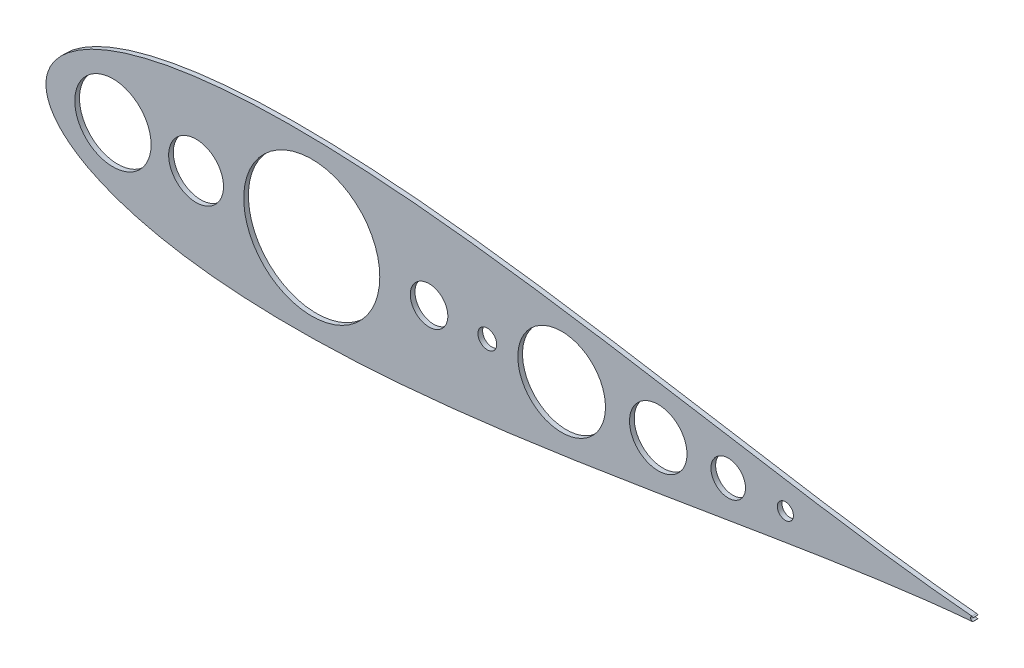
ISO-10303-21;
HEADER;
FILE_DESCRIPTION(('STEP AP214'),'2;1');
FILE_NAME('part.step','',(''),(''),'','','');
FILE_SCHEMA(('AUTOMOTIVE_DESIGN { 1 0 10303 214 1 1 1 1 }'));
ENDSEC;
DATA;
#1=APPLICATION_CONTEXT('core data for automotive mechanical design processes');
#2=APPLICATION_PROTOCOL_DEFINITION('international standard','automotive_design',2000,#1);
#3=PRODUCT_CONTEXT('',#1,'mechanical');
#4=PRODUCT('Part','Part','',(#3));
#5=PRODUCT_RELATED_PRODUCT_CATEGORY('part','',(#4));
#6=PRODUCT_DEFINITION_FORMATION('','',#4);
#7=PRODUCT_DEFINITION_CONTEXT('part definition',#1,'design');
#8=PRODUCT_DEFINITION('design','',#6,#7);
#9=PRODUCT_DEFINITION_SHAPE('','',#8);
#10=(LENGTH_UNIT() NAMED_UNIT(*) SI_UNIT(.MILLI.,.METRE.));
#11=(NAMED_UNIT(*) PLANE_ANGLE_UNIT() SI_UNIT($,.RADIAN.));
#12=(NAMED_UNIT(*) SI_UNIT($,.STERADIAN.) SOLID_ANGLE_UNIT());
#13=UNCERTAINTY_MEASURE_WITH_UNIT(LENGTH_MEASURE(1.E-05),#10,'distance_accuracy_value','');
#14=(GEOMETRIC_REPRESENTATION_CONTEXT(3) GLOBAL_UNCERTAINTY_ASSIGNED_CONTEXT((#13)) GLOBAL_UNIT_ASSIGNED_CONTEXT((#10,
#11,#12)) REPRESENTATION_CONTEXT('',''));
#15=CARTESIAN_POINT('',(0.,0.,0.));
#16=DIRECTION('',(0.,0.,1.));
#17=DIRECTION('',(1.,0.,0.));
#18=AXIS2_PLACEMENT_3D('',#15,#16,#17);
#19=CARTESIAN_POINT('',(758.723197977063,1063.57436572714,4.76249999999927));
#20=DIRECTION('',(0.,0.,1.));
#21=DIRECTION('',(1.,0.,0.));
#22=AXIS2_PLACEMENT_3D('',#19,#20,#21);
#23=PLANE('',#22);
#24=CARTESIAN_POINT('',(1219.83442511048,1063.57436573083,4.76249999999927));
#25=DIRECTION('',(0.,0.,1.));
#26=DIRECTION('',(1.,0.,0.));
#27=AXIS2_PLACEMENT_3D('',#24,#25,#26);
#28=CIRCLE('',#27,11.6857374411643);
#29=CARTESIAN_POINT('',(1231.52016255164,1063.57436573083,4.76249999999927));
#30=VERTEX_POINT('',#29);
#31=EDGE_CURVE('E163',#30,#30,#28,.T.);
#32=ORIENTED_EDGE('',*,*,#31,.F.);
#33=EDGE_LOOP('',(#32));
#34=FACE_BOUND('',#33,.T.);
#35=CARTESIAN_POINT('',(1258.45838062848,1063.57436573083,4.76249999999927));
#36=DIRECTION('',(0.,0.,1.));
#37=DIRECTION('',(1.,0.,0.));
#38=AXIS2_PLACEMENT_3D('',#35,#36,#37);
#39=CIRCLE('',#38,5.44282403304253);
#40=CARTESIAN_POINT('',(1263.90120466152,1063.57436573083,4.76249999999927));
#41=VERTEX_POINT('',#40);
#42=EDGE_CURVE('E151',#41,#41,#39,.T.);
#43=ORIENTED_EDGE('',*,*,#42,.F.);
#44=EDGE_LOOP('',(#43));
#45=FACE_BOUND('',#44,.T.);
#46=CARTESIAN_POINT('',(1107.25735157064,1063.57436573083,4.76249999999927));
#47=DIRECTION('',(0.,0.,1.));
#48=DIRECTION('',(1.,0.,0.));
#49=AXIS2_PLACEMENT_3D('',#46,#47,#48);
#50=CIRCLE('',#49,29.6169512640359);
#51=CARTESIAN_POINT('',(1136.87430283467,1063.57436573083,4.76249999999927));
#52=VERTEX_POINT('',#51);
#53=EDGE_CURVE('E139',#52,#52,#50,.T.);
#54=ORIENTED_EDGE('',*,*,#53,.F.);
#55=EDGE_LOOP('',(#54));
#56=FACE_BOUND('',#55,.T.);
#57=CARTESIAN_POINT('',(1017.63555797232,1063.57436573083,4.76249999999927));
#58=DIRECTION('',(0.,0.,1.));
#59=DIRECTION('',(1.,0.,0.));
#60=AXIS2_PLACEMENT_3D('',#57,#58,#59);
#61=CIRCLE('',#60,12.6999999999999);
#62=CARTESIAN_POINT('',(1030.33555797232,1063.57436573083,4.76249999999927));
#63=VERTEX_POINT('',#62);
#64=EDGE_CURVE('E127',#63,#63,#61,.T.);
#65=ORIENTED_EDGE('',*,*,#64,.F.);
#66=EDGE_LOOP('',(#65));
#67=FACE_BOUND('',#66,.T.);
#68=CARTESIAN_POINT('',(1384.52876517963,1065.11527182625,4.76249999999927));
#69=CARTESIAN_POINT('',(1384.02476213035,1065.15718452131,4.76249999999927));
#70=CARTESIAN_POINT('',(1380.22648946649,1065.47711992799,4.76249999999927));
#71=CARTESIAN_POINT('',(1372.74625618499,1066.16850319753,4.76249999999927));
#72=CARTESIAN_POINT('',(1361.64295494114,1067.32353879595,4.76249999999927));
#73=CARTESIAN_POINT('',(1349.33243678812,1068.740879557,4.76249999999927));
#74=CARTESIAN_POINT('',(1335.86097850786,1070.42902212665,4.76249999999927));
#75=CARTESIAN_POINT('',(1321.29143026592,1072.38968533435,4.76249999999927));
#76=CARTESIAN_POINT('',(1305.68679767246,1074.6184734418,4.76249999999927));
#77=CARTESIAN_POINT('',(1289.11465442426,1077.1038738023,4.76249999999927));
#78=CARTESIAN_POINT('',(1271.64537389958,1079.82820574053,4.76249999999927));
#79=CARTESIAN_POINT('',(1253.35214216277,1082.76714448684,4.76249999999927));
#80=CARTESIAN_POINT('',(1234.31055779802,1085.89033484042,4.76249999999927));
#81=CARTESIAN_POINT('',(1214.59841215053,1089.16177044972,4.76249999999927));
#82=CARTESIAN_POINT('',(1194.29543727282,1092.54015896586,4.76249999999927));
#83=CARTESIAN_POINT('',(1173.48317231756,1095.97966142064,4.76249999999927));
#84=CARTESIAN_POINT('',(1152.24482943002,1099.43044253804,4.76249999999927));
#85=CARTESIAN_POINT('',(1130.66522359839,1102.83948764531,4.76249999999927));
#86=CARTESIAN_POINT('',(1108.83072668498,1106.1513171936,4.76249999999927));
#87=CARTESIAN_POINT('',(1086.82926397921,1109.30897155002,4.76249999999927));
#88=CARTESIAN_POINT('',(1064.75030390188,1112.25473368101,4.76249999999927));
#89=CARTESIAN_POINT('',(1042.68487972075,1114.93115790073,4.76249999999927));
#90=CARTESIAN_POINT('',(1020.7256046701,1117.28189551246,4.76249999999927));
#91=CARTESIAN_POINT('',(998.966686102161,1119.25268985639,4.76249999999927));
#92=CARTESIAN_POINT('',(977.503916490937,1120.79216777564,4.76249999999927));
#93=CARTESIAN_POINT('',(956.434671568882,1121.85280026317,4.76249999999927));
#94=CARTESIAN_POINT('',(935.857889145089,1122.39179670956,4.76249999999927));
#95=CARTESIAN_POINT('',(915.87403544894,1122.37178605684,4.76249999999927));
#96=CARTESIAN_POINT('',(896.585138925508,1121.76102426004,4.76249999999927));
#97=CARTESIAN_POINT('',(878.09479183107,1120.53559812027,4.76249999999927));
#98=CARTESIAN_POINT('',(860.508451255152,1118.67773775714,4.76249999999927));
#99=CARTESIAN_POINT('',(843.933606128678,1116.17906861112,4.76249999999927));
#100=CARTESIAN_POINT('',(828.48078196209,1113.03871417805,4.76249999999927));
#101=CARTESIAN_POINT('',(814.264291248921,1109.26718267302,4.76249999999927));
#102=CARTESIAN_POINT('',(801.40432049451,1104.88657812327,4.76249999999927));
#103=CARTESIAN_POINT('',(790.029160439735,1099.93593245104,4.76249999999927));
#104=CARTESIAN_POINT('',(780.276948560624,1094.48080322715,4.76249999999927));
#105=CARTESIAN_POINT('',(772.293378489355,1088.63189111833,4.76249999999927));
#106=CARTESIAN_POINT('',(766.212884437445,1082.58022996062,4.76249999999927));
#107=CARTESIAN_POINT('',(762.096292775234,1076.64579093286,4.76249999999927));
#108=CARTESIAN_POINT('',(759.800766540714,1071.29174703656,4.76249999999927));
#109=CARTESIAN_POINT('',(758.873789657516,1066.99680363022,4.76249999999927));
#110=CARTESIAN_POINT('',(758.662662320994,1063.57436572714,4.76249999999927));
#111=CARTESIAN_POINT('',(758.873789657516,1060.15192782405,4.76249999999927));
#112=CARTESIAN_POINT('',(759.800766540714,1055.85698441772,4.76249999999927));
#113=CARTESIAN_POINT('',(762.096292775234,1050.50294052141,4.76249999999927));
#114=CARTESIAN_POINT('',(766.212884437445,1044.56850149365,4.76249999999927));
#115=CARTESIAN_POINT('',(772.293378489355,1038.51684033594,4.76249999999927));
#116=CARTESIAN_POINT('',(780.276948560624,1032.66792822712,4.76249999999927));
#117=CARTESIAN_POINT('',(790.029160439735,1027.21279900323,4.76249999999927));
#118=CARTESIAN_POINT('',(801.40432049451,1022.262153331,4.76249999999927));
#119=CARTESIAN_POINT('',(814.264291248921,1017.88154878125,4.76249999999927));
#120=CARTESIAN_POINT('',(828.48078196209,1014.11001727622,4.76249999999927));
#121=CARTESIAN_POINT('',(843.933606128678,1010.96966284315,4.76249999999927));
#122=CARTESIAN_POINT('',(860.508451255152,1008.47099369713,4.76249999999927));
#123=CARTESIAN_POINT('',(878.094791831069,1006.613133334,4.76249999999927));
#124=CARTESIAN_POINT('',(896.585138925508,1005.38770719423,4.76249999999927));
#125=CARTESIAN_POINT('',(915.87403544894,1004.77694539743,4.76249999999927));
#126=CARTESIAN_POINT('',(935.857889145088,1004.75693474471,4.76249999999927));
#127=CARTESIAN_POINT('',(956.434671568882,1005.2959311911,4.76249999999927));
#128=CARTESIAN_POINT('',(977.503916490937,1006.35656367863,4.76249999999927));
#129=CARTESIAN_POINT('',(998.966686102161,1007.89604159788,4.76249999999927));
#130=CARTESIAN_POINT('',(1020.7256046701,1009.86683594181,4.76249999999927));
#131=CARTESIAN_POINT('',(1042.68487972075,1012.21757355354,4.76249999999927));
#132=CARTESIAN_POINT('',(1064.75030390188,1014.89399777326,4.76249999999927));
#133=CARTESIAN_POINT('',(1086.82926397921,1017.83975990425,4.76249999999927));
#134=CARTESIAN_POINT('',(1108.83072668498,1020.99741426067,4.76249999999927));
#135=CARTESIAN_POINT('',(1130.66522359839,1024.30924380896,4.76249999999927));
#136=CARTESIAN_POINT('',(1152.24482943002,1027.71828891623,4.76249999999927));
#137=CARTESIAN_POINT('',(1173.48317231756,1031.16907003363,4.76249999999927));
#138=CARTESIAN_POINT('',(1194.29543727282,1034.60857248841,4.76249999999927));
#139=CARTESIAN_POINT('',(1214.59841215053,1037.98696100455,4.76249999999927));
#140=CARTESIAN_POINT('',(1234.31055779802,1041.25839661385,4.76249999999927));
#141=CARTESIAN_POINT('',(1253.35214216277,1044.38158696743,4.76249999999927));
#142=CARTESIAN_POINT('',(1271.64537389958,1047.32052571374,4.76249999999927));
#143=CARTESIAN_POINT('',(1289.11465442426,1050.04485765197,4.76249999999927));
#144=CARTESIAN_POINT('',(1305.68679767246,1052.53025801247,4.76249999999927));
#145=CARTESIAN_POINT('',(1321.29143026592,1054.75904611992,4.76249999999927));
#146=CARTESIAN_POINT('',(1335.86097850786,1056.71970932762,4.76249999999927));
#147=CARTESIAN_POINT('',(1349.33243678812,1058.40785189727,4.76249999999927));
#148=CARTESIAN_POINT('',(1361.64295494114,1059.82519265832,4.76249999999927));
#149=CARTESIAN_POINT('',(1372.74625618499,1060.98022825674,4.76249999999927));
#150=CARTESIAN_POINT('',(1380.22648946649,1061.67161152628,4.76249999999927));
#151=CARTESIAN_POINT('',(1384.02476213035,1061.99154693296,4.76249999999927));
#152=CARTESIAN_POINT('',(1384.52876517963,1062.03345963541,4.76249999999927));
#153=B_SPLINE_CURVE_WITH_KNOTS('',3,(#68,#69,#70,#71,#72,#73,#74,#75,#76,#77,#78,#79,#80,#81,
#82,#83,#84,#85,#86,#87,#88,#89,#90,#91,#92,#93,#94,#95,#96,#97,#98,#99,#100,#101,#102,#103,
#104,#105,#106,#107,#108,#109,#110,#111,#112,#113,#114,#115,#116,#117,#118,#119,#120,#121,#122,
#123,#124,#125,#126,#127,#128,#129,#130,#131,#132,#133,#134,#135,#136,#137,#138,#139,#140,#141,
#142,#143,#144,#145,#146,#147,#148,#149,#150,#151,#152),.UNSPECIFIED.,.F.,.F.,(4,1,1,1,1,1,1,1,
1,1,1,1,1,1,1,1,1,1,1,1,1,1,1,1,1,1,1,1,1,1,1,1,1,1,1,1,1,1,1,1,1,1,1,1,1,1,1,1,1,1,1,1,1,1,1,1,
1,1,1,1,1,1,1,1,1,1,1,1,1,1,1,1,1,1,1,1,1,1,1,1,1,1,4),(0.020157042076269,0.0212708876900959,
0.0285525550130683,0.0367806836725549,0.0459201019032637,0.0559317636633187,0.0667728836144854,
0.0783971303496518,0.0907548266908363,0.103793164577546,0.117456431914319,0.131686225652521,
0.146421738497113,0.161599998000845,0.177156132626574,0.193023668070302,0.209134785631037,
0.225420632511523,0.241811601924249,0.258237646860869,0.274628556698349,0.290914287398014,
0.307025228908797,0.322892517177238,0.33844834182358,0.353626206573582,0.368361231970712,
0.382590427827798,0.396252960572084,0.40929041186716,0.421647009590257,0.433269881487031,
0.444109248914041,0.454118639688981,0.463255054987312,0.471479113777303,0.478755288570903,
0.485052318112802,0.490344025694165,0.494609832614287,0.497833231437255,0.5,0.502166768562745,
0.505390167385713,0.509655974305835,0.514947681887198,0.521244711429097,0.528520886222697,
0.536744945012688,0.545881360311019,0.555890751085959,0.566730118512969,0.578352990409744,
0.59070958813284,0.603747039427916,0.617409572172202,0.631638768029288,0.646373793426418,
0.66155165817642,0.677107482822761,0.692974771091203,0.709085712601986,0.725371443301651,
0.741762353139131,0.758188398075751,0.774579367488477,0.790865214368963,0.806976331929698,
0.822843867373426,0.838400001999155,0.853578261502887,0.868313774347479,0.882543568085681,
0.896206835422454,0.909245173309164,0.921602869650348,0.933227116385514,0.944068236336681,
0.954079898096736,0.963219316327445,0.971447444986932,0.978729112309904,0.979842957923731),.UNSPECIFIED.);
#154=CARTESIAN_POINT('',(1384.52876517963,1065.11527182625,4.76249999999927));
#155=VERTEX_POINT('',#154);
#156=CARTESIAN_POINT('',(1384.52876517963,1062.03345963541,4.76249999999927));
#157=VERTEX_POINT('',#156);
#158=EDGE_CURVE('E87',#155,#157,#153,.T.);
#159=ORIENTED_EDGE('',*,*,#158,.T.);
#160=CARTESIAN_POINT('',(1384.40062402416,1063.57436573083,4.76249999999927));
#161=DIRECTION('',(0.,0.,1.));
#162=DIRECTION('',(1.,0.,0.));
#163=AXIS2_PLACEMENT_3D('',#160,#161,#162);
#164=CIRCLE('',#163,1.54622499999997);
#165=CARTESIAN_POINT('',(1385.4942760864,1062.4813255132,4.76249999999927));
#166=VERTEX_POINT('',#165);
#167=EDGE_CURVE('E82',#157,#166,#164,.T.);
#168=ORIENTED_EDGE('',*,*,#167,.T.);
#169=CARTESIAN_POINT('',(1384.88588559903,1063.57436573083,4.76249999999927));
#170=DIRECTION('',(0.,0.,-1.));
#171=DIRECTION('',(1.,0.,0.));
#172=AXIS2_PLACEMENT_3D('',#169,#170,#171);
#173=CIRCLE('',#172,1.25094999999987);
#174=CARTESIAN_POINT('',(1385.4942760864,1064.66740594847,4.76249999999927));
#175=VERTEX_POINT('',#174);
#176=EDGE_CURVE('E85',#166,#175,#173,.T.);
#177=ORIENTED_EDGE('',*,*,#176,.T.);
#178=CARTESIAN_POINT('',(1384.40062402416,1063.57436573083,4.76249999999927));
#179=DIRECTION('',(0.,0.,1.));
#180=DIRECTION('',(1.,0.,0.));
#181=AXIS2_PLACEMENT_3D('',#178,#179,#180);
#182=CIRCLE('',#181,1.54622499999997);
#183=EDGE_CURVE('E52',#175,#155,#182,.T.);
#184=ORIENTED_EDGE('',*,*,#183,.T.);
#185=EDGE_LOOP('',(#159,#168,#177,#184));
#186=FACE_BOUND('',#185,.T.);
#187=CARTESIAN_POINT('',(803.964814443437,1063.57436573083,4.76249999999927));
#188=DIRECTION('',(0.,0.,1.));
#189=DIRECTION('',(1.,0.,0.));
#190=AXIS2_PLACEMENT_3D('',#187,#188,#189);
#191=CIRCLE('',#190,25.786210390976);
#192=CARTESIAN_POINT('',(829.751024834413,1063.57436573083,4.76249999999927));
#193=VERTEX_POINT('',#192);
#194=EDGE_CURVE('E103',#193,#193,#191,.T.);
#195=ORIENTED_EDGE('',*,*,#194,.F.);
#196=EDGE_LOOP('',(#195));
#197=FACE_BOUND('',#196,.T.);
#198=CARTESIAN_POINT('',(1172.54365064472,1063.57436573083,4.76249999999927));
#199=DIRECTION('',(0.,0.,1.));
#200=DIRECTION('',(1.,0.,0.));
#201=AXIS2_PLACEMENT_3D('',#198,#199,#200);
#202=CIRCLE('',#201,19.4199336188586);
#203=CARTESIAN_POINT('',(1191.96358426358,1063.57436573083,4.76249999999927));
#204=VERTEX_POINT('',#203);
#205=EDGE_CURVE('E133',#204,#204,#202,.T.);
#206=ORIENTED_EDGE('',*,*,#205,.F.);
#207=EDGE_LOOP('',(#206));
#208=FACE_BOUND('',#207,.T.);
#209=CARTESIAN_POINT('',(938.344553526957,1063.57436573083,4.76249999999927));
#210=DIRECTION('',(0.,0.,1.));
#211=DIRECTION('',(1.,0.,0.));
#212=AXIS2_PLACEMENT_3D('',#209,#210,#211);
#213=CIRCLE('',#212,45.9816728780185);
#214=CARTESIAN_POINT('',(984.326226404976,1063.57436573083,4.76249999999927));
#215=VERTEX_POINT('',#214);
#216=EDGE_CURVE('E145',#215,#215,#213,.T.);
#217=ORIENTED_EDGE('',*,*,#216,.F.);
#218=EDGE_LOOP('',(#217));
#219=FACE_BOUND('',#218,.T.);
#220=CARTESIAN_POINT('',(860.155557972317,1063.57436573083,4.76249999999927));
#221=DIRECTION('',(0.,0.,1.));
#222=DIRECTION('',(1.,0.,0.));
#223=AXIS2_PLACEMENT_3D('',#220,#221,#222);
#224=CIRCLE('',#223,18.5420000000001);
#225=CARTESIAN_POINT('',(878.697557972317,1063.57436573083,4.76249999999927));
#226=VERTEX_POINT('',#225);
#227=EDGE_CURVE('E157',#226,#226,#224,.T.);
#228=ORIENTED_EDGE('',*,*,#227,.F.);
#229=EDGE_LOOP('',(#228));
#230=FACE_BOUND('',#229,.T.);
#231=CARTESIAN_POINT('',(1057.00555797232,1063.57436573083,4.76249999999927));
#232=DIRECTION('',(0.,0.,1.));
#233=DIRECTION('',(1.,0.,0.));
#234=AXIS2_PLACEMENT_3D('',#231,#232,#233);
#235=CIRCLE('',#234,6.35000000000008);
#236=CARTESIAN_POINT('',(1063.35555797232,1063.57436573083,4.76249999999927));
#237=VERTEX_POINT('',#236);
#238=EDGE_CURVE('E169',#237,#237,#235,.T.);
#239=ORIENTED_EDGE('',*,*,#238,.F.);
#240=EDGE_LOOP('',(#239));
#241=FACE_BOUND('',#240,.T.);
#242=ADVANCED_FACE('F34',(#34,#45,#56,#67,#186,#197,#208,#219,#230,#241),#23,.T.);
#243=CARTESIAN_POINT('',(758.723197977063,1063.57436572714,1.58749999999927));
#244=DIRECTION('',(0.,0.,1.));
#245=DIRECTION('',(1.,0.,0.));
#246=AXIS2_PLACEMENT_3D('',#243,#244,#245);
#247=PLANE('',#246);
#248=CARTESIAN_POINT('',(1384.52876517963,1065.11527182625,1.58749999999927));
#249=CARTESIAN_POINT('',(1384.02476213035,1065.15718452131,1.58749999999927));
#250=CARTESIAN_POINT('',(1380.22648946649,1065.47711992799,1.58749999999927));
#251=CARTESIAN_POINT('',(1372.74625618499,1066.16850319753,1.58749999999927));
#252=CARTESIAN_POINT('',(1361.64295494114,1067.32353879595,1.58749999999927));
#253=CARTESIAN_POINT('',(1349.33243678812,1068.740879557,1.58749999999927));
#254=CARTESIAN_POINT('',(1335.86097850786,1070.42902212665,1.58749999999927));
#255=CARTESIAN_POINT('',(1321.29143026592,1072.38968533435,1.58749999999927));
#256=CARTESIAN_POINT('',(1305.68679767246,1074.6184734418,1.58749999999927));
#257=CARTESIAN_POINT('',(1289.11465442426,1077.1038738023,1.58749999999927));
#258=CARTESIAN_POINT('',(1271.64537389958,1079.82820574053,1.58749999999927));
#259=CARTESIAN_POINT('',(1253.35214216277,1082.76714448684,1.58749999999927));
#260=CARTESIAN_POINT('',(1234.31055779802,1085.89033484042,1.58749999999927));
#261=CARTESIAN_POINT('',(1214.59841215053,1089.16177044972,1.58749999999927));
#262=CARTESIAN_POINT('',(1194.29543727282,1092.54015896586,1.58749999999927));
#263=CARTESIAN_POINT('',(1173.48317231756,1095.97966142064,1.58749999999927));
#264=CARTESIAN_POINT('',(1152.24482943002,1099.43044253804,1.58749999999927));
#265=CARTESIAN_POINT('',(1130.66522359839,1102.83948764531,1.58749999999927));
#266=CARTESIAN_POINT('',(1108.83072668498,1106.1513171936,1.58749999999927));
#267=CARTESIAN_POINT('',(1086.82926397921,1109.30897155002,1.58749999999927));
#268=CARTESIAN_POINT('',(1064.75030390188,1112.25473368101,1.58749999999927));
#269=CARTESIAN_POINT('',(1042.68487972075,1114.93115790073,1.58749999999927));
#270=CARTESIAN_POINT('',(1020.7256046701,1117.28189551246,1.58749999999927));
#271=CARTESIAN_POINT('',(998.966686102161,1119.25268985639,1.58749999999927));
#272=CARTESIAN_POINT('',(977.503916490937,1120.79216777564,1.58749999999927));
#273=CARTESIAN_POINT('',(956.434671568882,1121.85280026317,1.58749999999927));
#274=CARTESIAN_POINT('',(935.857889145089,1122.39179670956,1.58749999999927));
#275=CARTESIAN_POINT('',(915.87403544894,1122.37178605684,1.58749999999927));
#276=CARTESIAN_POINT('',(896.585138925508,1121.76102426004,1.58749999999927));
#277=CARTESIAN_POINT('',(878.09479183107,1120.53559812027,1.58749999999927));
#278=CARTESIAN_POINT('',(860.508451255152,1118.67773775714,1.58749999999927));
#279=CARTESIAN_POINT('',(843.933606128678,1116.17906861112,1.58749999999927));
#280=CARTESIAN_POINT('',(828.48078196209,1113.03871417805,1.58749999999927));
#281=CARTESIAN_POINT('',(814.264291248921,1109.26718267302,1.58749999999927));
#282=CARTESIAN_POINT('',(801.40432049451,1104.88657812327,1.58749999999927));
#283=CARTESIAN_POINT('',(790.029160439735,1099.93593245104,1.58749999999927));
#284=CARTESIAN_POINT('',(780.276948560624,1094.48080322715,1.58749999999927));
#285=CARTESIAN_POINT('',(772.293378489355,1088.63189111833,1.58749999999927));
#286=CARTESIAN_POINT('',(766.212884437445,1082.58022996062,1.58749999999927));
#287=CARTESIAN_POINT('',(762.096292775234,1076.64579093286,1.58749999999927));
#288=CARTESIAN_POINT('',(759.800766540714,1071.29174703656,1.58749999999927));
#289=CARTESIAN_POINT('',(758.873789657516,1066.99680363022,1.58749999999927));
#290=CARTESIAN_POINT('',(758.662662320994,1063.57436572714,1.58749999999927));
#291=CARTESIAN_POINT('',(758.873789657516,1060.15192782405,1.58749999999927));
#292=CARTESIAN_POINT('',(759.800766540714,1055.85698441772,1.58749999999927));
#293=CARTESIAN_POINT('',(762.096292775234,1050.50294052141,1.58749999999927));
#294=CARTESIAN_POINT('',(766.212884437445,1044.56850149365,1.58749999999927));
#295=CARTESIAN_POINT('',(772.293378489355,1038.51684033594,1.58749999999927));
#296=CARTESIAN_POINT('',(780.276948560624,1032.66792822712,1.58749999999927));
#297=CARTESIAN_POINT('',(790.029160439735,1027.21279900323,1.58749999999927));
#298=CARTESIAN_POINT('',(801.40432049451,1022.262153331,1.58749999999927));
#299=CARTESIAN_POINT('',(814.264291248921,1017.88154878125,1.58749999999927));
#300=CARTESIAN_POINT('',(828.48078196209,1014.11001727622,1.58749999999927));
#301=CARTESIAN_POINT('',(843.933606128678,1010.96966284315,1.58749999999927));
#302=CARTESIAN_POINT('',(860.508451255152,1008.47099369713,1.58749999999927));
#303=CARTESIAN_POINT('',(878.094791831069,1006.613133334,1.58749999999927));
#304=CARTESIAN_POINT('',(896.585138925508,1005.38770719423,1.58749999999927));
#305=CARTESIAN_POINT('',(915.87403544894,1004.77694539743,1.58749999999927));
#306=CARTESIAN_POINT('',(935.857889145088,1004.75693474471,1.58749999999927));
#307=CARTESIAN_POINT('',(956.434671568882,1005.2959311911,1.58749999999927));
#308=CARTESIAN_POINT('',(977.503916490937,1006.35656367863,1.58749999999927));
#309=CARTESIAN_POINT('',(998.966686102161,1007.89604159788,1.58749999999927));
#310=CARTESIAN_POINT('',(1020.7256046701,1009.86683594181,1.58749999999927));
#311=CARTESIAN_POINT('',(1042.68487972075,1012.21757355354,1.58749999999927));
#312=CARTESIAN_POINT('',(1064.75030390188,1014.89399777326,1.58749999999927));
#313=CARTESIAN_POINT('',(1086.82926397921,1017.83975990425,1.58749999999927));
#314=CARTESIAN_POINT('',(1108.83072668498,1020.99741426067,1.58749999999927));
#315=CARTESIAN_POINT('',(1130.66522359839,1024.30924380896,1.58749999999927));
#316=CARTESIAN_POINT('',(1152.24482943002,1027.71828891623,1.58749999999927));
#317=CARTESIAN_POINT('',(1173.48317231756,1031.16907003363,1.58749999999927));
#318=CARTESIAN_POINT('',(1194.29543727282,1034.60857248841,1.58749999999927));
#319=CARTESIAN_POINT('',(1214.59841215053,1037.98696100455,1.58749999999927));
#320=CARTESIAN_POINT('',(1234.31055779802,1041.25839661385,1.58749999999927));
#321=CARTESIAN_POINT('',(1253.35214216277,1044.38158696743,1.58749999999927));
#322=CARTESIAN_POINT('',(1271.64537389958,1047.32052571374,1.58749999999927));
#323=CARTESIAN_POINT('',(1289.11465442426,1050.04485765197,1.58749999999927));
#324=CARTESIAN_POINT('',(1305.68679767246,1052.53025801247,1.58749999999927));
#325=CARTESIAN_POINT('',(1321.29143026592,1054.75904611992,1.58749999999927));
#326=CARTESIAN_POINT('',(1335.86097850786,1056.71970932762,1.58749999999927));
#327=CARTESIAN_POINT('',(1349.33243678812,1058.40785189727,1.58749999999927));
#328=CARTESIAN_POINT('',(1361.64295494114,1059.82519265832,1.58749999999927));
#329=CARTESIAN_POINT('',(1372.74625618499,1060.98022825674,1.58749999999927));
#330=CARTESIAN_POINT('',(1380.22648946649,1061.67161152628,1.58749999999927));
#331=CARTESIAN_POINT('',(1384.02476213035,1061.99154693296,1.58749999999927));
#332=CARTESIAN_POINT('',(1384.52876517963,1062.03345963541,1.58749999999927));
#333=B_SPLINE_CURVE_WITH_KNOTS('',3,(#248,#249,#250,#251,#252,#253,#254,#255,#256,#257,#258,
#259,#260,#261,#262,#263,#264,#265,#266,#267,#268,#269,#270,#271,#272,#273,#274,#275,#276,#277,
#278,#279,#280,#281,#282,#283,#284,#285,#286,#287,#288,#289,#290,#291,#292,#293,#294,#295,#296,
#297,#298,#299,#300,#301,#302,#303,#304,#305,#306,#307,#308,#309,#310,#311,#312,#313,#314,#315,
#316,#317,#318,#319,#320,#321,#322,#323,#324,#325,#326,#327,#328,#329,#330,#331,#332),
.UNSPECIFIED.,.F.,.F.,(4,1,1,1,1,1,1,1,1,1,1,1,1,1,1,1,1,1,1,1,1,1,1,1,1,1,1,1,1,1,1,1,1,1,1,1,
1,1,1,1,1,1,1,1,1,1,1,1,1,1,1,1,1,1,1,1,1,1,1,1,1,1,1,1,1,1,1,1,1,1,1,1,1,1,1,1,1,1,1,1,1,1,4),
(0.020157042076269,0.0212708876900959,0.0285525550130683,0.0367806836725549,0.0459201019032637,
0.0559317636633187,0.0667728836144854,0.0783971303496518,0.0907548266908363,0.103793164577546,
0.117456431914319,0.131686225652521,0.146421738497113,0.161599998000845,0.177156132626574,
0.193023668070302,0.209134785631037,0.225420632511523,0.241811601924249,0.258237646860869,
0.274628556698349,0.290914287398014,0.307025228908797,0.322892517177238,0.33844834182358,
0.353626206573582,0.368361231970712,0.382590427827798,0.396252960572084,0.40929041186716,
0.421647009590257,0.433269881487031,0.444109248914041,0.454118639688981,0.463255054987312,
0.471479113777303,0.478755288570903,0.485052318112802,0.490344025694165,0.494609832614287,
0.497833231437255,0.5,0.502166768562745,0.505390167385713,0.509655974305835,0.514947681887198,
0.521244711429097,0.528520886222697,0.536744945012688,0.545881360311019,0.555890751085959,
0.566730118512969,0.578352990409744,0.59070958813284,0.603747039427916,0.617409572172202,
0.631638768029288,0.646373793426418,0.66155165817642,0.677107482822761,0.692974771091203,
0.709085712601986,0.725371443301651,0.741762353139131,0.758188398075751,0.774579367488477,
0.790865214368963,0.806976331929698,0.822843867373426,0.838400001999155,0.853578261502887,
0.868313774347479,0.882543568085681,0.896206835422454,0.909245173309164,0.921602869650348,
0.933227116385514,0.944068236336681,0.954079898096736,0.963219316327445,0.971447444986932,
0.978729112309904,0.979842957923731),.UNSPECIFIED.);
#334=CARTESIAN_POINT('',(1384.52876517963,1065.11527182625,1.58749999999927));
#335=VERTEX_POINT('',#334);
#336=CARTESIAN_POINT('',(1384.52876517963,1062.03345963541,1.58749999999927));
#337=VERTEX_POINT('',#336);
#338=EDGE_CURVE('E98',#335,#337,#333,.T.);
#339=ORIENTED_EDGE('',*,*,#338,.F.);
#340=CARTESIAN_POINT('',(1384.40062402416,1063.57436573083,1.58749999999927));
#341=DIRECTION('',(0.,0.,1.));
#342=DIRECTION('',(1.,0.,0.));
#343=AXIS2_PLACEMENT_3D('',#340,#341,#342);
#344=CIRCLE('',#343,1.54622499999997);
#345=CARTESIAN_POINT('',(1385.4942760864,1064.66740594847,1.58749999999927));
#346=VERTEX_POINT('',#345);
#347=EDGE_CURVE('E75',#346,#335,#344,.T.);
#348=ORIENTED_EDGE('',*,*,#347,.F.);
#349=CARTESIAN_POINT('',(1384.88588559903,1063.57436573083,1.58749999999927));
#350=DIRECTION('',(0.,0.,-1.));
#351=DIRECTION('',(1.,0.,0.));
#352=AXIS2_PLACEMENT_3D('',#349,#350,#351);
#353=CIRCLE('',#352,1.25094999999987);
#354=CARTESIAN_POINT('',(1385.4942760864,1062.4813255132,1.58749999999927));
#355=VERTEX_POINT('',#354);
#356=EDGE_CURVE('E69',#355,#346,#353,.T.);
#357=ORIENTED_EDGE('',*,*,#356,.F.);
#358=CARTESIAN_POINT('',(1384.40062402416,1063.57436573083,1.58749999999927));
#359=DIRECTION('',(0.,0.,1.));
#360=DIRECTION('',(1.,0.,0.));
#361=AXIS2_PLACEMENT_3D('',#358,#359,#360);
#362=CIRCLE('',#361,1.54622499999997);
#363=EDGE_CURVE('E91',#337,#355,#362,.T.);
#364=ORIENTED_EDGE('',*,*,#363,.F.);
#365=EDGE_LOOP('',(#339,#348,#357,#364));
#366=FACE_BOUND('',#365,.T.);
#367=CARTESIAN_POINT('',(803.964814443437,1063.57436573083,1.58749999999927));
#368=DIRECTION('',(0.,0.,1.));
#369=DIRECTION('',(1.,0.,0.));
#370=AXIS2_PLACEMENT_3D('',#367,#368,#369);
#371=CIRCLE('',#370,25.786210390976);
#372=CARTESIAN_POINT('',(829.751024834413,1063.57436573083,1.58749999999927));
#373=VERTEX_POINT('',#372);
#374=EDGE_CURVE('E121',#373,#373,#371,.T.);
#375=ORIENTED_EDGE('',*,*,#374,.T.);
#376=EDGE_LOOP('',(#375));
#377=FACE_BOUND('',#376,.T.);
#378=CARTESIAN_POINT('',(1017.63555797232,1063.57436573083,1.58749999999927));
#379=DIRECTION('',(0.,0.,1.));
#380=DIRECTION('',(1.,0.,0.));
#381=AXIS2_PLACEMENT_3D('',#378,#379,#380);
#382=CIRCLE('',#381,12.6999999999999);
#383=CARTESIAN_POINT('',(1030.33555797232,1063.57436573083,1.58749999999927));
#384=VERTEX_POINT('',#383);
#385=EDGE_CURVE('E130',#384,#384,#382,.T.);
#386=ORIENTED_EDGE('',*,*,#385,.T.);
#387=EDGE_LOOP('',(#386));
#388=FACE_BOUND('',#387,.T.);
#389=CARTESIAN_POINT('',(1172.54365064472,1063.57436573083,1.58749999999927));
#390=DIRECTION('',(0.,0.,1.));
#391=DIRECTION('',(1.,0.,0.));
#392=AXIS2_PLACEMENT_3D('',#389,#390,#391);
#393=CIRCLE('',#392,19.4199336188586);
#394=CARTESIAN_POINT('',(1191.96358426358,1063.57436573083,1.58749999999927));
#395=VERTEX_POINT('',#394);
#396=EDGE_CURVE('E136',#395,#395,#393,.T.);
#397=ORIENTED_EDGE('',*,*,#396,.T.);
#398=EDGE_LOOP('',(#397));
#399=FACE_BOUND('',#398,.T.);
#400=CARTESIAN_POINT('',(1107.25735157064,1063.57436573083,1.58749999999927));
#401=DIRECTION('',(0.,0.,1.));
#402=DIRECTION('',(1.,0.,0.));
#403=AXIS2_PLACEMENT_3D('',#400,#401,#402);
#404=CIRCLE('',#403,29.6169512640359);
#405=CARTESIAN_POINT('',(1136.87430283467,1063.57436573083,1.58749999999927));
#406=VERTEX_POINT('',#405);
#407=EDGE_CURVE('E142',#406,#406,#404,.T.);
#408=ORIENTED_EDGE('',*,*,#407,.T.);
#409=EDGE_LOOP('',(#408));
#410=FACE_BOUND('',#409,.T.);
#411=CARTESIAN_POINT('',(938.344553526957,1063.57436573083,1.58749999999927));
#412=DIRECTION('',(0.,0.,1.));
#413=DIRECTION('',(1.,0.,0.));
#414=AXIS2_PLACEMENT_3D('',#411,#412,#413);
#415=CIRCLE('',#414,45.9816728780185);
#416=CARTESIAN_POINT('',(984.326226404976,1063.57436573083,1.58749999999927));
#417=VERTEX_POINT('',#416);
#418=EDGE_CURVE('E148',#417,#417,#415,.T.);
#419=ORIENTED_EDGE('',*,*,#418,.T.);
#420=EDGE_LOOP('',(#419));
#421=FACE_BOUND('',#420,.T.);
#422=CARTESIAN_POINT('',(1258.45838062848,1063.57436573083,1.58749999999927));
#423=DIRECTION('',(0.,0.,1.));
#424=DIRECTION('',(1.,0.,0.));
#425=AXIS2_PLACEMENT_3D('',#422,#423,#424);
#426=CIRCLE('',#425,5.44282403304253);
#427=CARTESIAN_POINT('',(1263.90120466152,1063.57436573083,1.58749999999927));
#428=VERTEX_POINT('',#427);
#429=EDGE_CURVE('E154',#428,#428,#426,.T.);
#430=ORIENTED_EDGE('',*,*,#429,.T.);
#431=EDGE_LOOP('',(#430));
#432=FACE_BOUND('',#431,.T.);
#433=CARTESIAN_POINT('',(860.155557972317,1063.57436573083,1.58749999999927));
#434=DIRECTION('',(0.,0.,1.));
#435=DIRECTION('',(1.,0.,0.));
#436=AXIS2_PLACEMENT_3D('',#433,#434,#435);
#437=CIRCLE('',#436,18.5420000000001);
#438=CARTESIAN_POINT('',(878.697557972317,1063.57436573083,1.58749999999927));
#439=VERTEX_POINT('',#438);
#440=EDGE_CURVE('E160',#439,#439,#437,.T.);
#441=ORIENTED_EDGE('',*,*,#440,.T.);
#442=EDGE_LOOP('',(#441));
#443=FACE_BOUND('',#442,.T.);
#444=CARTESIAN_POINT('',(1219.83442511048,1063.57436573083,1.58749999999927));
#445=DIRECTION('',(0.,0.,1.));
#446=DIRECTION('',(1.,0.,0.));
#447=AXIS2_PLACEMENT_3D('',#444,#445,#446);
#448=CIRCLE('',#447,11.6857374411643);
#449=CARTESIAN_POINT('',(1231.52016255164,1063.57436573083,1.58749999999927));
#450=VERTEX_POINT('',#449);
#451=EDGE_CURVE('E166',#450,#450,#448,.T.);
#452=ORIENTED_EDGE('',*,*,#451,.T.);
#453=EDGE_LOOP('',(#452));
#454=FACE_BOUND('',#453,.T.);
#455=CARTESIAN_POINT('',(1057.00555797232,1063.57436573083,1.58749999999927));
#456=DIRECTION('',(0.,0.,1.));
#457=DIRECTION('',(1.,0.,0.));
#458=AXIS2_PLACEMENT_3D('',#455,#456,#457);
#459=CIRCLE('',#458,6.35000000000008);
#460=CARTESIAN_POINT('',(1063.35555797232,1063.57436573083,1.58749999999927));
#461=VERTEX_POINT('',#460);
#462=EDGE_CURVE('E172',#461,#461,#459,.T.);
#463=ORIENTED_EDGE('',*,*,#462,.T.);
#464=EDGE_LOOP('',(#463));
#465=FACE_BOUND('',#464,.T.);
#466=ADVANCED_FACE('F114',(#366,#377,#388,#399,#410,#421,#432,#443,#454,#465),#247,.F.);
#467=DIRECTION('',(0.,0.,-1.));
#468=VECTOR('',#467,1.);
#469=SURFACE_OF_LINEAR_EXTRUSION('',#153,#468);
#470=ORIENTED_EDGE('',*,*,#338,.T.);
#471=DIRECTION('',(0.,0.,-1.));
#472=VECTOR('',#471,1.);
#473=CARTESIAN_POINT('',(1384.52876517963,1062.03345963541,4.76249999999927));
#474=LINE('',#473,#472);
#475=EDGE_CURVE('E11',#157,#337,#474,.T.);
#476=ORIENTED_EDGE('',*,*,#475,.F.);
#477=ORIENTED_EDGE('',*,*,#158,.F.);
#478=DIRECTION('',(0.,0.,-1.));
#479=VECTOR('',#478,1.);
#480=CARTESIAN_POINT('',(1384.52876517963,1065.11527182625,4.76249999999927));
#481=LINE('',#480,#479);
#482=EDGE_CURVE('E95',#155,#335,#481,.T.);
#483=ORIENTED_EDGE('',*,*,#482,.T.);
#484=EDGE_LOOP('',(#470,#476,#477,#483));
#485=FACE_BOUND('',#484,.T.);
#486=ADVANCED_FACE('F36',(#485),#469,.F.);
#487=CARTESIAN_POINT('',(1384.40062402416,1063.57436573083,4.76249999999927));
#488=DIRECTION('',(0.,0.,-1.));
#489=DIRECTION('',(-1.,0.,0.));
#490=AXIS2_PLACEMENT_3D('',#487,#488,#489);
#491=CYLINDRICAL_SURFACE('',#490,1.54622499999997);
#492=ORIENTED_EDGE('',*,*,#363,.T.);
#493=DIRECTION('',(0.,0.,-1.));
#494=VECTOR('',#493,1.);
#495=CARTESIAN_POINT('',(1385.4942760864,1062.4813255132,4.76249999999927));
#496=LINE('',#495,#494);
#497=EDGE_CURVE('E44',#166,#355,#496,.T.);
#498=ORIENTED_EDGE('',*,*,#497,.F.);
#499=ORIENTED_EDGE('',*,*,#167,.F.);
#500=ORIENTED_EDGE('',*,*,#475,.T.);
#501=EDGE_LOOP('',(#492,#498,#499,#500));
#502=FACE_BOUND('',#501,.T.);
#503=ADVANCED_FACE('F90',(#502),#491,.T.);
#504=CARTESIAN_POINT('',(1384.88588559903,1063.57436573083,4.76249999999927));
#505=DIRECTION('',(0.,0.,-1.));
#506=DIRECTION('',(-1.,0.,0.));
#507=AXIS2_PLACEMENT_3D('',#504,#505,#506);
#508=CYLINDRICAL_SURFACE('',#507,1.25094999999987);
#509=ORIENTED_EDGE('',*,*,#356,.T.);
#510=DIRECTION('',(0.,0.,-1.));
#511=VECTOR('',#510,1.);
#512=CARTESIAN_POINT('',(1385.4942760864,1064.66740594847,4.76249999999927));
#513=LINE('',#512,#511);
#514=EDGE_CURVE('E92',#175,#346,#513,.T.);
#515=ORIENTED_EDGE('',*,*,#514,.F.);
#516=ORIENTED_EDGE('',*,*,#176,.F.);
#517=ORIENTED_EDGE('',*,*,#497,.T.);
#518=EDGE_LOOP('',(#509,#515,#516,#517));
#519=FACE_BOUND('',#518,.T.);
#520=ADVANCED_FACE('F93',(#519),#508,.F.);
#521=CARTESIAN_POINT('',(1384.40062402416,1063.57436573083,4.76249999999927));
#522=DIRECTION('',(0.,0.,-1.));
#523=DIRECTION('',(-1.,0.,0.));
#524=AXIS2_PLACEMENT_3D('',#521,#522,#523);
#525=CYLINDRICAL_SURFACE('',#524,1.54622499999997);
#526=ORIENTED_EDGE('',*,*,#347,.T.);
#527=ORIENTED_EDGE('',*,*,#482,.F.);
#528=ORIENTED_EDGE('',*,*,#183,.F.);
#529=ORIENTED_EDGE('',*,*,#514,.T.);
#530=EDGE_LOOP('',(#526,#527,#528,#529));
#531=FACE_BOUND('',#530,.T.);
#532=ADVANCED_FACE('F111',(#531),#525,.T.);
#533=CARTESIAN_POINT('',(803.964814443437,1063.57436573083,4.76249999999927));
#534=DIRECTION('',(0.,0.,-1.));
#535=DIRECTION('',(-1.,0.,0.));
#536=AXIS2_PLACEMENT_3D('',#533,#534,#535);
#537=CYLINDRICAL_SURFACE('',#536,25.786210390976);
#538=ORIENTED_EDGE('',*,*,#194,.T.);
#539=EDGE_LOOP('',(#538));
#540=FACE_BOUND('',#539,.T.);
#541=ORIENTED_EDGE('',*,*,#374,.F.);
#542=EDGE_LOOP('',(#541));
#543=FACE_BOUND('',#542,.T.);
#544=ADVANCED_FACE('F191',(#540,#543),#537,.F.);
#545=CARTESIAN_POINT('',(1017.63555797232,1063.57436573083,4.76249999999927));
#546=DIRECTION('',(0.,0.,-1.));
#547=DIRECTION('',(-1.,0.,0.));
#548=AXIS2_PLACEMENT_3D('',#545,#546,#547);
#549=CYLINDRICAL_SURFACE('',#548,12.6999999999999);
#550=ORIENTED_EDGE('',*,*,#64,.T.);
#551=EDGE_LOOP('',(#550));
#552=FACE_BOUND('',#551,.T.);
#553=ORIENTED_EDGE('',*,*,#385,.F.);
#554=EDGE_LOOP('',(#553));
#555=FACE_BOUND('',#554,.T.);
#556=ADVANCED_FACE('F237',(#552,#555),#549,.F.);
#557=CARTESIAN_POINT('',(1172.54365064472,1063.57436573083,4.76249999999927));
#558=DIRECTION('',(0.,0.,-1.));
#559=DIRECTION('',(-1.,0.,0.));
#560=AXIS2_PLACEMENT_3D('',#557,#558,#559);
#561=CYLINDRICAL_SURFACE('',#560,19.4199336188586);
#562=ORIENTED_EDGE('',*,*,#205,.T.);
#563=EDGE_LOOP('',(#562));
#564=FACE_BOUND('',#563,.T.);
#565=ORIENTED_EDGE('',*,*,#396,.F.);
#566=EDGE_LOOP('',(#565));
#567=FACE_BOUND('',#566,.T.);
#568=ADVANCED_FACE('F245',(#564,#567),#561,.F.);
#569=CARTESIAN_POINT('',(1107.25735157064,1063.57436573083,4.76249999999927));
#570=DIRECTION('',(0.,0.,-1.));
#571=DIRECTION('',(-1.,0.,0.));
#572=AXIS2_PLACEMENT_3D('',#569,#570,#571);
#573=CYLINDRICAL_SURFACE('',#572,29.6169512640359);
#574=ORIENTED_EDGE('',*,*,#53,.T.);
#575=EDGE_LOOP('',(#574));
#576=FACE_BOUND('',#575,.T.);
#577=ORIENTED_EDGE('',*,*,#407,.F.);
#578=EDGE_LOOP('',(#577));
#579=FACE_BOUND('',#578,.T.);
#580=ADVANCED_FACE('F253',(#576,#579),#573,.F.);
#581=CARTESIAN_POINT('',(938.344553526957,1063.57436573083,4.76249999999927));
#582=DIRECTION('',(0.,0.,-1.));
#583=DIRECTION('',(-1.,0.,0.));
#584=AXIS2_PLACEMENT_3D('',#581,#582,#583);
#585=CYLINDRICAL_SURFACE('',#584,45.9816728780185);
#586=ORIENTED_EDGE('',*,*,#216,.T.);
#587=EDGE_LOOP('',(#586));
#588=FACE_BOUND('',#587,.T.);
#589=ORIENTED_EDGE('',*,*,#418,.F.);
#590=EDGE_LOOP('',(#589));
#591=FACE_BOUND('',#590,.T.);
#592=ADVANCED_FACE('F262',(#588,#591),#585,.F.);
#593=CARTESIAN_POINT('',(1258.45838062848,1063.57436573083,4.76249999999927));
#594=DIRECTION('',(0.,0.,-1.));
#595=DIRECTION('',(-1.,0.,0.));
#596=AXIS2_PLACEMENT_3D('',#593,#594,#595);
#597=CYLINDRICAL_SURFACE('',#596,5.44282403304253);
#598=ORIENTED_EDGE('',*,*,#42,.T.);
#599=EDGE_LOOP('',(#598));
#600=FACE_BOUND('',#599,.T.);
#601=ORIENTED_EDGE('',*,*,#429,.F.);
#602=EDGE_LOOP('',(#601));
#603=FACE_BOUND('',#602,.T.);
#604=ADVANCED_FACE('F271',(#600,#603),#597,.F.);
#605=CARTESIAN_POINT('',(860.155557972317,1063.57436573083,4.76249999999927));
#606=DIRECTION('',(0.,0.,-1.));
#607=DIRECTION('',(-1.,0.,0.));
#608=AXIS2_PLACEMENT_3D('',#605,#606,#607);
#609=CYLINDRICAL_SURFACE('',#608,18.5420000000001);
#610=ORIENTED_EDGE('',*,*,#227,.T.);
#611=EDGE_LOOP('',(#610));
#612=FACE_BOUND('',#611,.T.);
#613=ORIENTED_EDGE('',*,*,#440,.F.);
#614=EDGE_LOOP('',(#613));
#615=FACE_BOUND('',#614,.T.);
#616=ADVANCED_FACE('F280',(#612,#615),#609,.F.);
#617=CARTESIAN_POINT('',(1219.83442511048,1063.57436573083,4.76249999999927));
#618=DIRECTION('',(0.,0.,-1.));
#619=DIRECTION('',(-1.,0.,0.));
#620=AXIS2_PLACEMENT_3D('',#617,#618,#619);
#621=CYLINDRICAL_SURFACE('',#620,11.6857374411643);
#622=ORIENTED_EDGE('',*,*,#31,.T.);
#623=EDGE_LOOP('',(#622));
#624=FACE_BOUND('',#623,.T.);
#625=ORIENTED_EDGE('',*,*,#451,.F.);
#626=EDGE_LOOP('',(#625));
#627=FACE_BOUND('',#626,.T.);
#628=ADVANCED_FACE('F289',(#624,#627),#621,.F.);
#629=CARTESIAN_POINT('',(1057.00555797232,1063.57436573083,4.76249999999927));
#630=DIRECTION('',(0.,0.,-1.));
#631=DIRECTION('',(-1.,0.,0.));
#632=AXIS2_PLACEMENT_3D('',#629,#630,#631);
#633=CYLINDRICAL_SURFACE('',#632,6.35000000000008);
#634=ORIENTED_EDGE('',*,*,#238,.T.);
#635=EDGE_LOOP('',(#634));
#636=FACE_BOUND('',#635,.T.);
#637=ORIENTED_EDGE('',*,*,#462,.F.);
#638=EDGE_LOOP('',(#637));
#639=FACE_BOUND('',#638,.T.);
#640=ADVANCED_FACE('F178',(#636,#639),#633,.F.);
#641=CLOSED_SHELL('',(#242,#466,#486,#503,#520,#532,#544,#556,#568,#580,#592,#604,#616,#628,#640));
#642=MANIFOLD_SOLID_BREP('B2',#641);
#643=ADVANCED_BREP_SHAPE_REPRESENTATION('',(#18,#642),#14);
#644=SHAPE_DEFINITION_REPRESENTATION(#9,#643);
ENDSEC;
END-ISO-10303-21;
